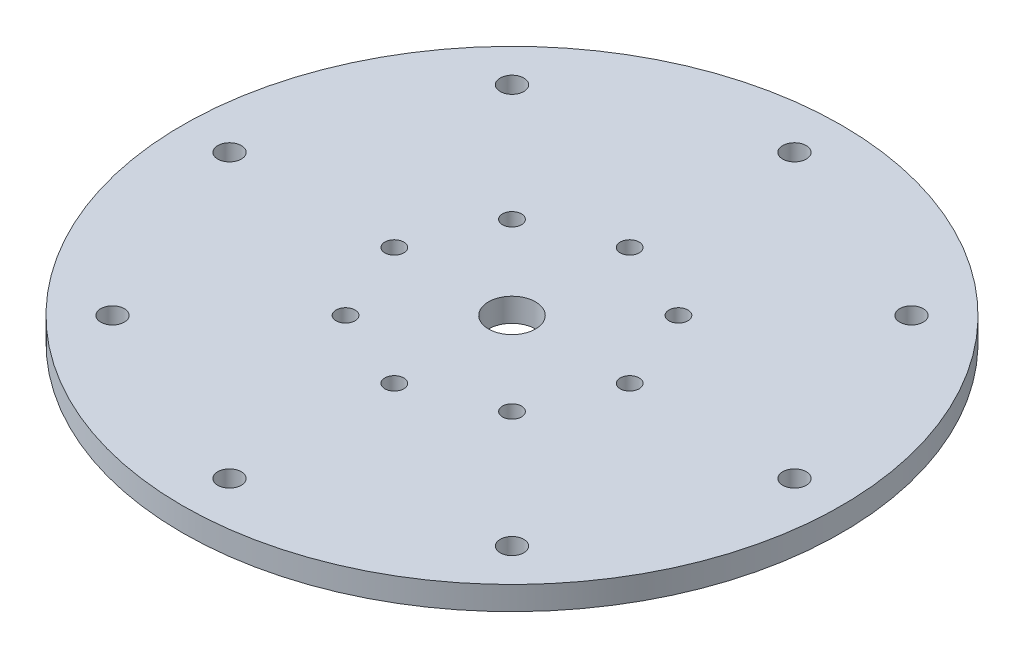
ISO-10303-21;
HEADER;
FILE_DESCRIPTION(('STEP AP214'),'2;1');
FILE_NAME('part.step','',(''),(''),'','','');
FILE_SCHEMA(('AUTOMOTIVE_DESIGN { 1 0 10303 214 1 1 1 1 }'));
ENDSEC;
DATA;
#1=APPLICATION_CONTEXT('core data for automotive mechanical design processes');
#2=APPLICATION_PROTOCOL_DEFINITION('international standard','automotive_design',2000,#1);
#3=PRODUCT_CONTEXT('',#1,'mechanical');
#4=PRODUCT('Part','Part','',(#3));
#5=PRODUCT_RELATED_PRODUCT_CATEGORY('part','',(#4));
#6=PRODUCT_DEFINITION_FORMATION('','',#4);
#7=PRODUCT_DEFINITION_CONTEXT('part definition',#1,'design');
#8=PRODUCT_DEFINITION('design','',#6,#7);
#9=PRODUCT_DEFINITION_SHAPE('','',#8);
#10=(LENGTH_UNIT() NAMED_UNIT(*) SI_UNIT(.MILLI.,.METRE.));
#11=(NAMED_UNIT(*) PLANE_ANGLE_UNIT() SI_UNIT($,.RADIAN.));
#12=(NAMED_UNIT(*) SI_UNIT($,.STERADIAN.) SOLID_ANGLE_UNIT());
#13=UNCERTAINTY_MEASURE_WITH_UNIT(LENGTH_MEASURE(1.E-05),#10,'distance_accuracy_value','');
#14=(GEOMETRIC_REPRESENTATION_CONTEXT(3) GLOBAL_UNCERTAINTY_ASSIGNED_CONTEXT((#13)) GLOBAL_UNIT_ASSIGNED_CONTEXT((#10,
#11,#12)) REPRESENTATION_CONTEXT('',''));
#15=CARTESIAN_POINT('',(0.,0.,0.));
#16=DIRECTION('',(0.,0.,1.));
#17=DIRECTION('',(1.,0.,0.));
#18=AXIS2_PLACEMENT_3D('',#15,#16,#17);
#19=CARTESIAN_POINT('',(0.,6.35,0.));
#20=DIRECTION('',(0.,1.,0.));
#21=DIRECTION('',(0.,0.,1.));
#22=AXIS2_PLACEMENT_3D('',#19,#20,#21);
#23=PLANE('',#22);
#24=CARTESIAN_POINT('',(53.8815367264156,6.35,53.8815367264143));
#25=DIRECTION('',(0.,1.,0.));
#26=DIRECTION('',(0.,0.,1.));
#27=AXIS2_PLACEMENT_3D('',#24,#25,#26);
#28=CIRCLE('',#27,3.17499999999999);
#29=CARTESIAN_POINT('',(53.8815367264156,6.35,57.0565367264142));
#30=VERTEX_POINT('',#29);
#31=EDGE_CURVE('E166',#30,#30,#28,.T.);
#32=ORIENTED_EDGE('',*,*,#31,.F.);
#33=EDGE_LOOP('',(#32));
#34=FACE_BOUND('',#33,.T.);
#35=CARTESIAN_POINT('',(7.96417910583563E-13,6.35,76.2));
#36=DIRECTION('',(0.,1.,0.));
#37=DIRECTION('',(0.,0.,1.));
#38=AXIS2_PLACEMENT_3D('',#35,#36,#37);
#39=CIRCLE('',#38,3.17499999999999);
#40=CARTESIAN_POINT('',(7.96417910583563E-13,6.35,79.375));
#41=VERTEX_POINT('',#40);
#42=EDGE_CURVE('E160',#41,#41,#39,.T.);
#43=ORIENTED_EDGE('',*,*,#42,.F.);
#44=EDGE_LOOP('',(#43));
#45=FACE_BOUND('',#44,.T.);
#46=CARTESIAN_POINT('',(-53.8815367264144,6.35,53.8815367264154));
#47=DIRECTION('',(0.,1.,0.));
#48=DIRECTION('',(0.,0.,1.));
#49=AXIS2_PLACEMENT_3D('',#46,#47,#48);
#50=CIRCLE('',#49,3.17499999999999);
#51=CARTESIAN_POINT('',(-53.8815367264144,6.35,57.0565367264154));
#52=VERTEX_POINT('',#51);
#53=EDGE_CURVE('E154',#52,#52,#50,.T.);
#54=ORIENTED_EDGE('',*,*,#53,.F.);
#55=EDGE_LOOP('',(#54));
#56=FACE_BOUND('',#55,.T.);
#57=CARTESIAN_POINT('',(-76.2,6.35,0.));
#58=DIRECTION('',(0.,1.,0.));
#59=DIRECTION('',(0.,0.,1.));
#60=AXIS2_PLACEMENT_3D('',#57,#58,#59);
#61=CIRCLE('',#60,3.17499999999998);
#62=CARTESIAN_POINT('',(-76.2,6.35,3.17499999999998));
#63=VERTEX_POINT('',#62);
#64=EDGE_CURVE('E148',#63,#63,#61,.T.);
#65=ORIENTED_EDGE('',*,*,#64,.F.);
#66=EDGE_LOOP('',(#65));
#67=FACE_BOUND('',#66,.T.);
#68=CARTESIAN_POINT('',(-53.8815367264152,6.35,-53.8815367264146));
#69=DIRECTION('',(0.,1.,0.));
#70=DIRECTION('',(0.,0.,1.));
#71=AXIS2_PLACEMENT_3D('',#68,#69,#70);
#72=CIRCLE('',#71,3.17499999999998);
#73=CARTESIAN_POINT('',(-53.8815367264152,6.35,-50.7065367264146));
#74=VERTEX_POINT('',#73);
#75=EDGE_CURVE('E142',#74,#74,#72,.T.);
#76=ORIENTED_EDGE('',*,*,#75,.F.);
#77=EDGE_LOOP('',(#76));
#78=FACE_BOUND('',#77,.T.);
#79=CARTESIAN_POINT('',(-2.6431615454387E-13,6.35,-76.2));
#80=DIRECTION('',(0.,1.,0.));
#81=DIRECTION('',(0.,0.,1.));
#82=AXIS2_PLACEMENT_3D('',#79,#80,#81);
#83=CIRCLE('',#82,3.17499999999999);
#84=CARTESIAN_POINT('',(-2.6431615454387E-13,6.35,-73.025));
#85=VERTEX_POINT('',#84);
#86=EDGE_CURVE('E136',#85,#85,#83,.T.);
#87=ORIENTED_EDGE('',*,*,#86,.F.);
#88=EDGE_LOOP('',(#87));
#89=FACE_BOUND('',#88,.T.);
#90=CARTESIAN_POINT('',(53.8815367264148,6.35,-53.881536726415));
#91=DIRECTION('',(0.,1.,0.));
#92=DIRECTION('',(0.,0.,1.));
#93=AXIS2_PLACEMENT_3D('',#90,#91,#92);
#94=CIRCLE('',#93,3.17499999999998);
#95=CARTESIAN_POINT('',(53.8815367264148,6.35,-50.706536726415));
#96=VERTEX_POINT('',#95);
#97=EDGE_CURVE('E130',#96,#96,#94,.T.);
#98=ORIENTED_EDGE('',*,*,#97,.F.);
#99=EDGE_LOOP('',(#98));
#100=FACE_BOUND('',#99,.T.);
#101=CARTESIAN_POINT('',(22.4506403026732,6.35,22.4506403026726));
#102=DIRECTION('',(0.,-1.,0.));
#103=DIRECTION('',(0.,0.,-1.));
#104=AXIS2_PLACEMENT_3D('',#101,#102,#103);
#105=CIRCLE('',#104,2.5527);
#106=CARTESIAN_POINT('',(22.4506403026732,6.35,19.8979403026726));
#107=VERTEX_POINT('',#106);
#108=EDGE_CURVE('E118',#107,#107,#105,.T.);
#109=ORIENTED_EDGE('',*,*,#108,.T.);
#110=EDGE_LOOP('',(#109));
#111=FACE_BOUND('',#110,.T.);
#112=CARTESIAN_POINT('',(3.32563597524808E-13,6.35,31.75));
#113=DIRECTION('',(0.,-1.,0.));
#114=DIRECTION('',(0.,0.,-1.));
#115=AXIS2_PLACEMENT_3D('',#112,#113,#114);
#116=CIRCLE('',#115,2.5527);
#117=CARTESIAN_POINT('',(3.32563597524808E-13,6.35,29.1973));
#118=VERTEX_POINT('',#117);
#119=EDGE_CURVE('E109',#118,#118,#116,.T.);
#120=ORIENTED_EDGE('',*,*,#119,.T.);
#121=EDGE_LOOP('',(#120));
#122=FACE_BOUND('',#121,.T.);
#123=CARTESIAN_POINT('',(-22.4506403026727,6.35,22.4506403026731));
#124=DIRECTION('',(0.,-1.,0.));
#125=DIRECTION('',(0.,0.,-1.));
#126=AXIS2_PLACEMENT_3D('',#123,#124,#125);
#127=CIRCLE('',#126,2.5527);
#128=CARTESIAN_POINT('',(-22.4506403026727,6.35,19.8979403026731));
#129=VERTEX_POINT('',#128);
#130=EDGE_CURVE('E100',#129,#129,#127,.T.);
#131=ORIENTED_EDGE('',*,*,#130,.T.);
#132=EDGE_LOOP('',(#131));
#133=FACE_BOUND('',#132,.T.);
#134=CARTESIAN_POINT('',(-31.75,6.35,0.));
#135=DIRECTION('',(0.,-1.,0.));
#136=DIRECTION('',(0.,0.,-1.));
#137=AXIS2_PLACEMENT_3D('',#134,#135,#136);
#138=CIRCLE('',#137,2.5527);
#139=CARTESIAN_POINT('',(-31.75,6.35,-2.5527));
#140=VERTEX_POINT('',#139);
#141=EDGE_CURVE('E91',#140,#140,#138,.T.);
#142=ORIENTED_EDGE('',*,*,#141,.T.);
#143=EDGE_LOOP('',(#142));
#144=FACE_BOUND('',#143,.T.);
#145=CARTESIAN_POINT('',(-22.450640302673,6.35,-22.4506403026728));
#146=DIRECTION('',(0.,-1.,0.));
#147=DIRECTION('',(0.,0.,-1.));
#148=AXIS2_PLACEMENT_3D('',#145,#146,#147);
#149=CIRCLE('',#148,2.5527);
#150=CARTESIAN_POINT('',(-22.450640302673,6.35,-25.0033403026728));
#151=VERTEX_POINT('',#150);
#152=EDGE_CURVE('E82',#151,#151,#149,.T.);
#153=ORIENTED_EDGE('',*,*,#152,.T.);
#154=EDGE_LOOP('',(#153));
#155=FACE_BOUND('',#154,.T.);
#156=CARTESIAN_POINT('',(-1.10854532508269E-13,6.35,-31.75));
#157=DIRECTION('',(0.,-1.,0.));
#158=DIRECTION('',(0.,0.,-1.));
#159=AXIS2_PLACEMENT_3D('',#156,#157,#158);
#160=CIRCLE('',#159,2.5527);
#161=CARTESIAN_POINT('',(-1.10854532508269E-13,6.35,-34.3027));
#162=VERTEX_POINT('',#161);
#163=EDGE_CURVE('E73',#162,#162,#160,.T.);
#164=ORIENTED_EDGE('',*,*,#163,.T.);
#165=EDGE_LOOP('',(#164));
#166=FACE_BOUND('',#165,.T.);
#167=CARTESIAN_POINT('',(22.4506403026728,6.35,-22.4506403026729));
#168=DIRECTION('',(0.,-1.,0.));
#169=DIRECTION('',(0.,0.,-1.));
#170=AXIS2_PLACEMENT_3D('',#167,#168,#169);
#171=CIRCLE('',#170,2.5527);
#172=CARTESIAN_POINT('',(22.4506403026728,6.35,-25.0033403026729));
#173=VERTEX_POINT('',#172);
#174=EDGE_CURVE('E64',#173,#173,#171,.T.);
#175=ORIENTED_EDGE('',*,*,#174,.T.);
#176=EDGE_LOOP('',(#175));
#177=FACE_BOUND('',#176,.T.);
#178=CARTESIAN_POINT('',(76.2,6.35,0.));
#179=DIRECTION('',(0.,1.,0.));
#180=DIRECTION('',(0.,0.,1.));
#181=AXIS2_PLACEMENT_3D('',#178,#179,#180);
#182=CIRCLE('',#181,3.17499999999998);
#183=CARTESIAN_POINT('',(76.2,6.35,3.17499999999999));
#184=VERTEX_POINT('',#183);
#185=EDGE_CURVE('E61',#184,#184,#182,.T.);
#186=ORIENTED_EDGE('',*,*,#185,.F.);
#187=EDGE_LOOP('',(#186));
#188=FACE_BOUND('',#187,.T.);
#189=CARTESIAN_POINT('',(31.75,6.35,0.));
#190=DIRECTION('',(0.,-1.,0.));
#191=DIRECTION('',(0.,0.,-1.));
#192=AXIS2_PLACEMENT_3D('',#189,#190,#191);
#193=CIRCLE('',#192,2.5527);
#194=CARTESIAN_POINT('',(31.75,6.35,-2.5527));
#195=VERTEX_POINT('',#194);
#196=EDGE_CURVE('E47',#195,#195,#193,.T.);
#197=ORIENTED_EDGE('',*,*,#196,.T.);
#198=EDGE_LOOP('',(#197));
#199=FACE_BOUND('',#198,.T.);
#200=CARTESIAN_POINT('',(0.,6.35,0.));
#201=DIRECTION('',(0.,1.,0.));
#202=DIRECTION('',(0.,0.,1.));
#203=AXIS2_PLACEMENT_3D('',#200,#201,#202);
#204=CIRCLE('',#203,88.9);
#205=CARTESIAN_POINT('',(0.,6.35,88.9));
#206=VERTEX_POINT('',#205);
#207=EDGE_CURVE('E10',#206,#206,#204,.T.);
#208=ORIENTED_EDGE('',*,*,#207,.T.);
#209=EDGE_LOOP('',(#208));
#210=FACE_BOUND('',#209,.T.);
#211=CARTESIAN_POINT('',(0.,6.35,0.));
#212=DIRECTION('',(0.,1.,0.));
#213=DIRECTION('',(0.,0.,1.));
#214=AXIS2_PLACEMENT_3D('',#211,#212,#213);
#215=CIRCLE('',#214,6.35);
#216=CARTESIAN_POINT('',(0.,6.35,6.35));
#217=VERTEX_POINT('',#216);
#218=EDGE_CURVE('E42',#217,#217,#215,.T.);
#219=ORIENTED_EDGE('',*,*,#218,.F.);
#220=EDGE_LOOP('',(#219));
#221=FACE_BOUND('',#220,.T.);
#222=ADVANCED_FACE('F31',(#34,#45,#56,#67,#78,#89,#100,#111,#122,#133,#144,#155,#166,#177,#188,
#199,#210,#221),#23,.T.);
#223=CARTESIAN_POINT('',(0.,0.,0.));
#224=DIRECTION('',(0.,1.,0.));
#225=DIRECTION('',(0.,0.,1.));
#226=AXIS2_PLACEMENT_3D('',#223,#224,#225);
#227=PLANE('',#226);
#228=CARTESIAN_POINT('',(53.8815367264156,0.,53.8815367264143));
#229=DIRECTION('',(0.,1.,0.));
#230=DIRECTION('',(0.,0.,1.));
#231=AXIS2_PLACEMENT_3D('',#228,#229,#230);
#232=CIRCLE('',#231,3.17499999999999);
#233=CARTESIAN_POINT('',(53.8815367264156,0.,57.0565367264142));
#234=VERTEX_POINT('',#233);
#235=EDGE_CURVE('E163',#234,#234,#232,.T.);
#236=ORIENTED_EDGE('',*,*,#235,.T.);
#237=EDGE_LOOP('',(#236));
#238=FACE_BOUND('',#237,.T.);
#239=CARTESIAN_POINT('',(7.96417910583563E-13,0.,76.2));
#240=DIRECTION('',(0.,1.,0.));
#241=DIRECTION('',(0.,0.,1.));
#242=AXIS2_PLACEMENT_3D('',#239,#240,#241);
#243=CIRCLE('',#242,3.17499999999999);
#244=CARTESIAN_POINT('',(7.96417910583563E-13,0.,79.375));
#245=VERTEX_POINT('',#244);
#246=EDGE_CURVE('E157',#245,#245,#243,.T.);
#247=ORIENTED_EDGE('',*,*,#246,.T.);
#248=EDGE_LOOP('',(#247));
#249=FACE_BOUND('',#248,.T.);
#250=CARTESIAN_POINT('',(-53.8815367264144,0.,53.8815367264154));
#251=DIRECTION('',(0.,1.,0.));
#252=DIRECTION('',(0.,0.,1.));
#253=AXIS2_PLACEMENT_3D('',#250,#251,#252);
#254=CIRCLE('',#253,3.17499999999999);
#255=CARTESIAN_POINT('',(-53.8815367264144,0.,57.0565367264154));
#256=VERTEX_POINT('',#255);
#257=EDGE_CURVE('E151',#256,#256,#254,.T.);
#258=ORIENTED_EDGE('',*,*,#257,.T.);
#259=EDGE_LOOP('',(#258));
#260=FACE_BOUND('',#259,.T.);
#261=CARTESIAN_POINT('',(-76.2,0.,0.));
#262=DIRECTION('',(0.,1.,0.));
#263=DIRECTION('',(0.,0.,1.));
#264=AXIS2_PLACEMENT_3D('',#261,#262,#263);
#265=CIRCLE('',#264,3.17499999999998);
#266=CARTESIAN_POINT('',(-76.2,0.,3.17499999999998));
#267=VERTEX_POINT('',#266);
#268=EDGE_CURVE('E145',#267,#267,#265,.T.);
#269=ORIENTED_EDGE('',*,*,#268,.T.);
#270=EDGE_LOOP('',(#269));
#271=FACE_BOUND('',#270,.T.);
#272=CARTESIAN_POINT('',(-53.8815367264152,0.,-53.8815367264146));
#273=DIRECTION('',(0.,1.,0.));
#274=DIRECTION('',(0.,0.,1.));
#275=AXIS2_PLACEMENT_3D('',#272,#273,#274);
#276=CIRCLE('',#275,3.17499999999998);
#277=CARTESIAN_POINT('',(-53.8815367264152,0.,-50.7065367264146));
#278=VERTEX_POINT('',#277);
#279=EDGE_CURVE('E139',#278,#278,#276,.T.);
#280=ORIENTED_EDGE('',*,*,#279,.T.);
#281=EDGE_LOOP('',(#280));
#282=FACE_BOUND('',#281,.T.);
#283=CARTESIAN_POINT('',(-2.6431615454387E-13,0.,-76.2));
#284=DIRECTION('',(0.,1.,0.));
#285=DIRECTION('',(0.,0.,1.));
#286=AXIS2_PLACEMENT_3D('',#283,#284,#285);
#287=CIRCLE('',#286,3.17499999999999);
#288=CARTESIAN_POINT('',(-2.6431615454387E-13,0.,-73.025));
#289=VERTEX_POINT('',#288);
#290=EDGE_CURVE('E133',#289,#289,#287,.T.);
#291=ORIENTED_EDGE('',*,*,#290,.T.);
#292=EDGE_LOOP('',(#291));
#293=FACE_BOUND('',#292,.T.);
#294=CARTESIAN_POINT('',(53.8815367264148,0.,-53.881536726415));
#295=DIRECTION('',(0.,1.,0.));
#296=DIRECTION('',(0.,0.,1.));
#297=AXIS2_PLACEMENT_3D('',#294,#295,#296);
#298=CIRCLE('',#297,3.17499999999998);
#299=CARTESIAN_POINT('',(53.8815367264148,0.,-50.706536726415));
#300=VERTEX_POINT('',#299);
#301=EDGE_CURVE('E127',#300,#300,#298,.T.);
#302=ORIENTED_EDGE('',*,*,#301,.T.);
#303=EDGE_LOOP('',(#302));
#304=FACE_BOUND('',#303,.T.);
#305=CARTESIAN_POINT('',(22.4506403026732,0.,22.4506403026726));
#306=DIRECTION('',(0.,-1.,0.));
#307=DIRECTION('',(0.,0.,-1.));
#308=AXIS2_PLACEMENT_3D('',#305,#306,#307);
#309=CIRCLE('',#308,4.8895);
#310=CARTESIAN_POINT('',(22.4506403026732,0.,17.5611403026726));
#311=VERTEX_POINT('',#310);
#312=EDGE_CURVE('E124',#311,#311,#309,.T.);
#313=ORIENTED_EDGE('',*,*,#312,.F.);
#314=EDGE_LOOP('',(#313));
#315=FACE_BOUND('',#314,.T.);
#316=CARTESIAN_POINT('',(3.32563597524808E-13,0.,31.75));
#317=DIRECTION('',(0.,-1.,0.));
#318=DIRECTION('',(0.,0.,-1.));
#319=AXIS2_PLACEMENT_3D('',#316,#317,#318);
#320=CIRCLE('',#319,4.8895);
#321=CARTESIAN_POINT('',(3.32563597524808E-13,0.,26.8605));
#322=VERTEX_POINT('',#321);
#323=EDGE_CURVE('E115',#322,#322,#320,.T.);
#324=ORIENTED_EDGE('',*,*,#323,.F.);
#325=EDGE_LOOP('',(#324));
#326=FACE_BOUND('',#325,.T.);
#327=CARTESIAN_POINT('',(-22.4506403026727,0.,22.4506403026731));
#328=DIRECTION('',(0.,-1.,0.));
#329=DIRECTION('',(0.,0.,-1.));
#330=AXIS2_PLACEMENT_3D('',#327,#328,#329);
#331=CIRCLE('',#330,4.8895);
#332=CARTESIAN_POINT('',(-22.4506403026727,0.,17.5611403026731));
#333=VERTEX_POINT('',#332);
#334=EDGE_CURVE('E106',#333,#333,#331,.T.);
#335=ORIENTED_EDGE('',*,*,#334,.F.);
#336=EDGE_LOOP('',(#335));
#337=FACE_BOUND('',#336,.T.);
#338=CARTESIAN_POINT('',(-31.75,0.,0.));
#339=DIRECTION('',(0.,-1.,0.));
#340=DIRECTION('',(0.,0.,-1.));
#341=AXIS2_PLACEMENT_3D('',#338,#339,#340);
#342=CIRCLE('',#341,4.8895);
#343=CARTESIAN_POINT('',(-31.75,0.,-4.8895));
#344=VERTEX_POINT('',#343);
#345=EDGE_CURVE('E97',#344,#344,#342,.T.);
#346=ORIENTED_EDGE('',*,*,#345,.F.);
#347=EDGE_LOOP('',(#346));
#348=FACE_BOUND('',#347,.T.);
#349=CARTESIAN_POINT('',(-22.450640302673,0.,-22.4506403026728));
#350=DIRECTION('',(0.,-1.,0.));
#351=DIRECTION('',(0.,0.,-1.));
#352=AXIS2_PLACEMENT_3D('',#349,#350,#351);
#353=CIRCLE('',#352,4.8895);
#354=CARTESIAN_POINT('',(-22.450640302673,0.,-27.3401403026728));
#355=VERTEX_POINT('',#354);
#356=EDGE_CURVE('E88',#355,#355,#353,.T.);
#357=ORIENTED_EDGE('',*,*,#356,.F.);
#358=EDGE_LOOP('',(#357));
#359=FACE_BOUND('',#358,.T.);
#360=CARTESIAN_POINT('',(-1.10854532508269E-13,0.,-31.75));
#361=DIRECTION('',(0.,-1.,0.));
#362=DIRECTION('',(0.,0.,-1.));
#363=AXIS2_PLACEMENT_3D('',#360,#361,#362);
#364=CIRCLE('',#363,4.8895);
#365=CARTESIAN_POINT('',(-1.10854532508269E-13,0.,-36.6395));
#366=VERTEX_POINT('',#365);
#367=EDGE_CURVE('E79',#366,#366,#364,.T.);
#368=ORIENTED_EDGE('',*,*,#367,.F.);
#369=EDGE_LOOP('',(#368));
#370=FACE_BOUND('',#369,.T.);
#371=CARTESIAN_POINT('',(22.4506403026728,0.,-22.4506403026729));
#372=DIRECTION('',(0.,-1.,0.));
#373=DIRECTION('',(0.,0.,-1.));
#374=AXIS2_PLACEMENT_3D('',#371,#372,#373);
#375=CIRCLE('',#374,4.8895);
#376=CARTESIAN_POINT('',(22.4506403026728,0.,-27.3401403026729));
#377=VERTEX_POINT('',#376);
#378=EDGE_CURVE('E70',#377,#377,#375,.T.);
#379=ORIENTED_EDGE('',*,*,#378,.F.);
#380=EDGE_LOOP('',(#379));
#381=FACE_BOUND('',#380,.T.);
#382=CARTESIAN_POINT('',(76.2,0.,0.));
#383=DIRECTION('',(0.,1.,0.));
#384=DIRECTION('',(0.,0.,1.));
#385=AXIS2_PLACEMENT_3D('',#382,#383,#384);
#386=CIRCLE('',#385,3.17499999999998);
#387=CARTESIAN_POINT('',(76.2,0.,3.17499999999999));
#388=VERTEX_POINT('',#387);
#389=EDGE_CURVE('E58',#388,#388,#386,.T.);
#390=ORIENTED_EDGE('',*,*,#389,.T.);
#391=EDGE_LOOP('',(#390));
#392=FACE_BOUND('',#391,.T.);
#393=CARTESIAN_POINT('',(31.75,0.,0.));
#394=DIRECTION('',(0.,-1.,0.));
#395=DIRECTION('',(0.,0.,-1.));
#396=AXIS2_PLACEMENT_3D('',#393,#394,#395);
#397=CIRCLE('',#396,4.8895);
#398=CARTESIAN_POINT('',(31.75,0.,-4.8895));
#399=VERTEX_POINT('',#398);
#400=EDGE_CURVE('E55',#399,#399,#397,.T.);
#401=ORIENTED_EDGE('',*,*,#400,.F.);
#402=EDGE_LOOP('',(#401));
#403=FACE_BOUND('',#402,.T.);
#404=CARTESIAN_POINT('',(0.,0.,0.));
#405=DIRECTION('',(0.,1.,0.));
#406=DIRECTION('',(0.,0.,1.));
#407=AXIS2_PLACEMENT_3D('',#404,#405,#406);
#408=CIRCLE('',#407,88.9);
#409=CARTESIAN_POINT('',(0.,0.,88.9));
#410=VERTEX_POINT('',#409);
#411=EDGE_CURVE('E35',#410,#410,#408,.T.);
#412=ORIENTED_EDGE('',*,*,#411,.F.);
#413=EDGE_LOOP('',(#412));
#414=FACE_BOUND('',#413,.T.);
#415=CARTESIAN_POINT('',(0.,0.,0.));
#416=DIRECTION('',(0.,1.,0.));
#417=DIRECTION('',(0.,0.,1.));
#418=AXIS2_PLACEMENT_3D('',#415,#416,#417);
#419=CIRCLE('',#418,6.35);
#420=CARTESIAN_POINT('',(0.,0.,6.35));
#421=VERTEX_POINT('',#420);
#422=EDGE_CURVE('E44',#421,#421,#419,.T.);
#423=ORIENTED_EDGE('',*,*,#422,.T.);
#424=EDGE_LOOP('',(#423));
#425=FACE_BOUND('',#424,.T.);
#426=ADVANCED_FACE('F174',(#238,#249,#260,#271,#282,#293,#304,#315,#326,#337,#348,#359,#370,
#381,#392,#403,#414,#425),#227,.F.);
#427=CARTESIAN_POINT('',(0.,6.35,0.));
#428=DIRECTION('',(0.,-1.,0.));
#429=DIRECTION('',(0.,0.,-1.));
#430=AXIS2_PLACEMENT_3D('',#427,#428,#429);
#431=CYLINDRICAL_SURFACE('',#430,88.9);
#432=ORIENTED_EDGE('',*,*,#207,.F.);
#433=EDGE_LOOP('',(#432));
#434=FACE_BOUND('',#433,.T.);
#435=ORIENTED_EDGE('',*,*,#411,.T.);
#436=EDGE_LOOP('',(#435));
#437=FACE_BOUND('',#436,.T.);
#438=ADVANCED_FACE('F33',(#434,#437),#431,.T.);
#439=CARTESIAN_POINT('',(0.,6.35,0.));
#440=DIRECTION('',(0.,-1.,0.));
#441=DIRECTION('',(0.,0.,-1.));
#442=AXIS2_PLACEMENT_3D('',#439,#440,#441);
#443=CYLINDRICAL_SURFACE('',#442,6.35);
#444=ORIENTED_EDGE('',*,*,#218,.T.);
#445=EDGE_LOOP('',(#444));
#446=FACE_BOUND('',#445,.T.);
#447=ORIENTED_EDGE('',*,*,#422,.F.);
#448=EDGE_LOOP('',(#447));
#449=FACE_BOUND('',#448,.T.);
#450=ADVANCED_FACE('F208',(#446,#449),#443,.F.);
#451=CARTESIAN_POINT('',(31.75,0.,0.));
#452=DIRECTION('',(0.,-1.,0.));
#453=DIRECTION('',(0.,0.,-1.));
#454=AXIS2_PLACEMENT_3D('',#451,#452,#453);
#455=CYLINDRICAL_SURFACE('',#454,2.5527);
#456=ORIENTED_EDGE('',*,*,#196,.F.);
#457=EDGE_LOOP('',(#456));
#458=FACE_BOUND('',#457,.T.);
#459=CARTESIAN_POINT('',(31.75,1.96080801813507,0.));
#460=DIRECTION('',(0.,-1.,0.));
#461=DIRECTION('',(0.,0.,-1.));
#462=AXIS2_PLACEMENT_3D('',#459,#460,#461);
#463=CIRCLE('',#462,2.5527);
#464=CARTESIAN_POINT('',(31.75,1.96080801813507,-2.5527));
#465=VERTEX_POINT('',#464);
#466=EDGE_CURVE('E52',#465,#465,#463,.T.);
#467=ORIENTED_EDGE('',*,*,#466,.T.);
#468=EDGE_LOOP('',(#467));
#469=FACE_BOUND('',#468,.T.);
#470=ADVANCED_FACE('F211',(#458,#469),#455,.F.);
#471=CARTESIAN_POINT('',(31.75,0.,0.));
#472=DIRECTION('',(0.,-1.,0.));
#473=DIRECTION('',(0.,0.,-1.));
#474=AXIS2_PLACEMENT_3D('',#471,#472,#473);
#475=CONICAL_SURFACE('',#474,4.8895,0.872664625997164);
#476=ORIENTED_EDGE('',*,*,#466,.F.);
#477=EDGE_LOOP('',(#476));
#478=FACE_BOUND('',#477,.T.);
#479=ORIENTED_EDGE('',*,*,#400,.T.);
#480=EDGE_LOOP('',(#479));
#481=FACE_BOUND('',#480,.T.);
#482=ADVANCED_FACE('F225',(#478,#481),#475,.F.);
#483=CARTESIAN_POINT('',(76.2,6.35,0.));
#484=DIRECTION('',(0.,1.,0.));
#485=DIRECTION('',(0.,0.,1.));
#486=AXIS2_PLACEMENT_3D('',#483,#484,#485);
#487=CYLINDRICAL_SURFACE('',#486,3.17499999999998);
#488=ORIENTED_EDGE('',*,*,#389,.F.);
#489=EDGE_LOOP('',(#488));
#490=FACE_BOUND('',#489,.T.);
#491=ORIENTED_EDGE('',*,*,#185,.T.);
#492=EDGE_LOOP('',(#491));
#493=FACE_BOUND('',#492,.T.);
#494=ADVANCED_FACE('F229',(#490,#493),#487,.F.);
#495=CARTESIAN_POINT('',(22.4506403026728,0.,-22.4506403026729));
#496=DIRECTION('',(0.,-1.,0.));
#497=DIRECTION('',(0.,0.,-1.));
#498=AXIS2_PLACEMENT_3D('',#495,#496,#497);
#499=CYLINDRICAL_SURFACE('',#498,2.5527);
#500=ORIENTED_EDGE('',*,*,#174,.F.);
#501=EDGE_LOOP('',(#500));
#502=FACE_BOUND('',#501,.T.);
#503=CARTESIAN_POINT('',(22.4506403026728,1.96080801813507,-22.4506403026729));
#504=DIRECTION('',(0.,-1.,0.));
#505=DIRECTION('',(0.,0.,-1.));
#506=AXIS2_PLACEMENT_3D('',#503,#504,#505);
#507=CIRCLE('',#506,2.5527);
#508=CARTESIAN_POINT('',(22.4506403026728,1.96080801813507,-25.0033403026729));
#509=VERTEX_POINT('',#508);
#510=EDGE_CURVE('E67',#509,#509,#507,.T.);
#511=ORIENTED_EDGE('',*,*,#510,.T.);
#512=EDGE_LOOP('',(#511));
#513=FACE_BOUND('',#512,.T.);
#514=ADVANCED_FACE('F233',(#502,#513),#499,.F.);
#515=CARTESIAN_POINT('',(22.4506403026728,0.,-22.4506403026729));
#516=DIRECTION('',(0.,-1.,0.));
#517=DIRECTION('',(0.,0.,-1.));
#518=AXIS2_PLACEMENT_3D('',#515,#516,#517);
#519=CONICAL_SURFACE('',#518,4.8895,0.872664625997164);
#520=ORIENTED_EDGE('',*,*,#510,.F.);
#521=EDGE_LOOP('',(#520));
#522=FACE_BOUND('',#521,.T.);
#523=ORIENTED_EDGE('',*,*,#378,.T.);
#524=EDGE_LOOP('',(#523));
#525=FACE_BOUND('',#524,.T.);
#526=ADVANCED_FACE('F237',(#522,#525),#519,.F.);
#527=CARTESIAN_POINT('',(-1.10854532508269E-13,0.,-31.75));
#528=DIRECTION('',(0.,-1.,0.));
#529=DIRECTION('',(0.,0.,-1.));
#530=AXIS2_PLACEMENT_3D('',#527,#528,#529);
#531=CYLINDRICAL_SURFACE('',#530,2.5527);
#532=ORIENTED_EDGE('',*,*,#163,.F.);
#533=EDGE_LOOP('',(#532));
#534=FACE_BOUND('',#533,.T.);
#535=CARTESIAN_POINT('',(-1.10854532508269E-13,1.96080801813507,-31.75));
#536=DIRECTION('',(0.,-1.,0.));
#537=DIRECTION('',(0.,0.,-1.));
#538=AXIS2_PLACEMENT_3D('',#535,#536,#537);
#539=CIRCLE('',#538,2.5527);
#540=CARTESIAN_POINT('',(-1.10854532508269E-13,1.96080801813507,-34.3027));
#541=VERTEX_POINT('',#540);
#542=EDGE_CURVE('E76',#541,#541,#539,.T.);
#543=ORIENTED_EDGE('',*,*,#542,.T.);
#544=EDGE_LOOP('',(#543));
#545=FACE_BOUND('',#544,.T.);
#546=ADVANCED_FACE('F241',(#534,#545),#531,.F.);
#547=CARTESIAN_POINT('',(-1.10854532508269E-13,0.,-31.75));
#548=DIRECTION('',(0.,-1.,0.));
#549=DIRECTION('',(0.,0.,-1.));
#550=AXIS2_PLACEMENT_3D('',#547,#548,#549);
#551=CONICAL_SURFACE('',#550,4.8895,0.872664625997164);
#552=ORIENTED_EDGE('',*,*,#542,.F.);
#553=EDGE_LOOP('',(#552));
#554=FACE_BOUND('',#553,.T.);
#555=ORIENTED_EDGE('',*,*,#367,.T.);
#556=EDGE_LOOP('',(#555));
#557=FACE_BOUND('',#556,.T.);
#558=ADVANCED_FACE('F245',(#554,#557),#551,.F.);
#559=CARTESIAN_POINT('',(-22.450640302673,0.,-22.4506403026728));
#560=DIRECTION('',(0.,-1.,0.));
#561=DIRECTION('',(0.,0.,-1.));
#562=AXIS2_PLACEMENT_3D('',#559,#560,#561);
#563=CYLINDRICAL_SURFACE('',#562,2.5527);
#564=ORIENTED_EDGE('',*,*,#152,.F.);
#565=EDGE_LOOP('',(#564));
#566=FACE_BOUND('',#565,.T.);
#567=CARTESIAN_POINT('',(-22.450640302673,1.96080801813507,-22.4506403026728));
#568=DIRECTION('',(0.,-1.,0.));
#569=DIRECTION('',(0.,0.,-1.));
#570=AXIS2_PLACEMENT_3D('',#567,#568,#569);
#571=CIRCLE('',#570,2.5527);
#572=CARTESIAN_POINT('',(-22.450640302673,1.96080801813507,-25.0033403026728));
#573=VERTEX_POINT('',#572);
#574=EDGE_CURVE('E85',#573,#573,#571,.T.);
#575=ORIENTED_EDGE('',*,*,#574,.T.);
#576=EDGE_LOOP('',(#575));
#577=FACE_BOUND('',#576,.T.);
#578=ADVANCED_FACE('F249',(#566,#577),#563,.F.);
#579=CARTESIAN_POINT('',(-22.450640302673,0.,-22.4506403026728));
#580=DIRECTION('',(0.,-1.,0.));
#581=DIRECTION('',(0.,0.,-1.));
#582=AXIS2_PLACEMENT_3D('',#579,#580,#581);
#583=CONICAL_SURFACE('',#582,4.8895,0.872664625997165);
#584=ORIENTED_EDGE('',*,*,#574,.F.);
#585=EDGE_LOOP('',(#584));
#586=FACE_BOUND('',#585,.T.);
#587=ORIENTED_EDGE('',*,*,#356,.T.);
#588=EDGE_LOOP('',(#587));
#589=FACE_BOUND('',#588,.T.);
#590=ADVANCED_FACE('F253',(#586,#589),#583,.F.);
#591=CARTESIAN_POINT('',(-31.75,0.,0.));
#592=DIRECTION('',(0.,-1.,0.));
#593=DIRECTION('',(0.,0.,-1.));
#594=AXIS2_PLACEMENT_3D('',#591,#592,#593);
#595=CYLINDRICAL_SURFACE('',#594,2.5527);
#596=ORIENTED_EDGE('',*,*,#141,.F.);
#597=EDGE_LOOP('',(#596));
#598=FACE_BOUND('',#597,.T.);
#599=CARTESIAN_POINT('',(-31.75,1.96080801813507,0.));
#600=DIRECTION('',(0.,-1.,0.));
#601=DIRECTION('',(0.,0.,-1.));
#602=AXIS2_PLACEMENT_3D('',#599,#600,#601);
#603=CIRCLE('',#602,2.5527);
#604=CARTESIAN_POINT('',(-31.75,1.96080801813507,-2.5527));
#605=VERTEX_POINT('',#604);
#606=EDGE_CURVE('E94',#605,#605,#603,.T.);
#607=ORIENTED_EDGE('',*,*,#606,.T.);
#608=EDGE_LOOP('',(#607));
#609=FACE_BOUND('',#608,.T.);
#610=ADVANCED_FACE('F257',(#598,#609),#595,.F.);
#611=CARTESIAN_POINT('',(-31.75,0.,0.));
#612=DIRECTION('',(0.,-1.,0.));
#613=DIRECTION('',(0.,0.,-1.));
#614=AXIS2_PLACEMENT_3D('',#611,#612,#613);
#615=CONICAL_SURFACE('',#614,4.8895,0.872664625997164);
#616=ORIENTED_EDGE('',*,*,#606,.F.);
#617=EDGE_LOOP('',(#616));
#618=FACE_BOUND('',#617,.T.);
#619=ORIENTED_EDGE('',*,*,#345,.T.);
#620=EDGE_LOOP('',(#619));
#621=FACE_BOUND('',#620,.T.);
#622=ADVANCED_FACE('F261',(#618,#621),#615,.F.);
#623=CARTESIAN_POINT('',(-22.4506403026727,0.,22.4506403026731));
#624=DIRECTION('',(0.,-1.,0.));
#625=DIRECTION('',(0.,0.,-1.));
#626=AXIS2_PLACEMENT_3D('',#623,#624,#625);
#627=CYLINDRICAL_SURFACE('',#626,2.5527);
#628=ORIENTED_EDGE('',*,*,#130,.F.);
#629=EDGE_LOOP('',(#628));
#630=FACE_BOUND('',#629,.T.);
#631=CARTESIAN_POINT('',(-22.4506403026727,1.96080801813507,22.4506403026731));
#632=DIRECTION('',(0.,-1.,0.));
#633=DIRECTION('',(0.,0.,-1.));
#634=AXIS2_PLACEMENT_3D('',#631,#632,#633);
#635=CIRCLE('',#634,2.5527);
#636=CARTESIAN_POINT('',(-22.4506403026727,1.96080801813507,19.8979403026731));
#637=VERTEX_POINT('',#636);
#638=EDGE_CURVE('E103',#637,#637,#635,.T.);
#639=ORIENTED_EDGE('',*,*,#638,.T.);
#640=EDGE_LOOP('',(#639));
#641=FACE_BOUND('',#640,.T.);
#642=ADVANCED_FACE('F265',(#630,#641),#627,.F.);
#643=CARTESIAN_POINT('',(-22.4506403026727,0.,22.4506403026731));
#644=DIRECTION('',(0.,-1.,0.));
#645=DIRECTION('',(0.,0.,-1.));
#646=AXIS2_PLACEMENT_3D('',#643,#644,#645);
#647=CONICAL_SURFACE('',#646,4.8895,0.872664625997165);
#648=ORIENTED_EDGE('',*,*,#638,.F.);
#649=EDGE_LOOP('',(#648));
#650=FACE_BOUND('',#649,.T.);
#651=ORIENTED_EDGE('',*,*,#334,.T.);
#652=EDGE_LOOP('',(#651));
#653=FACE_BOUND('',#652,.T.);
#654=ADVANCED_FACE('F269',(#650,#653),#647,.F.);
#655=CARTESIAN_POINT('',(3.32563597524808E-13,0.,31.75));
#656=DIRECTION('',(0.,-1.,0.));
#657=DIRECTION('',(0.,0.,-1.));
#658=AXIS2_PLACEMENT_3D('',#655,#656,#657);
#659=CYLINDRICAL_SURFACE('',#658,2.5527);
#660=ORIENTED_EDGE('',*,*,#119,.F.);
#661=EDGE_LOOP('',(#660));
#662=FACE_BOUND('',#661,.T.);
#663=CARTESIAN_POINT('',(3.32563597524808E-13,1.96080801813507,31.75));
#664=DIRECTION('',(0.,-1.,0.));
#665=DIRECTION('',(0.,0.,-1.));
#666=AXIS2_PLACEMENT_3D('',#663,#664,#665);
#667=CIRCLE('',#666,2.5527);
#668=CARTESIAN_POINT('',(3.32563597524808E-13,1.96080801813507,29.1973));
#669=VERTEX_POINT('',#668);
#670=EDGE_CURVE('E112',#669,#669,#667,.T.);
#671=ORIENTED_EDGE('',*,*,#670,.T.);
#672=EDGE_LOOP('',(#671));
#673=FACE_BOUND('',#672,.T.);
#674=ADVANCED_FACE('F273',(#662,#673),#659,.F.);
#675=CARTESIAN_POINT('',(3.32563597524808E-13,0.,31.75));
#676=DIRECTION('',(0.,-1.,0.));
#677=DIRECTION('',(0.,0.,-1.));
#678=AXIS2_PLACEMENT_3D('',#675,#676,#677);
#679=CONICAL_SURFACE('',#678,4.8895,0.872664625997164);
#680=ORIENTED_EDGE('',*,*,#670,.F.);
#681=EDGE_LOOP('',(#680));
#682=FACE_BOUND('',#681,.T.);
#683=ORIENTED_EDGE('',*,*,#323,.T.);
#684=EDGE_LOOP('',(#683));
#685=FACE_BOUND('',#684,.T.);
#686=ADVANCED_FACE('F277',(#682,#685),#679,.F.);
#687=CARTESIAN_POINT('',(22.4506403026732,0.,22.4506403026726));
#688=DIRECTION('',(0.,-1.,0.));
#689=DIRECTION('',(0.,0.,-1.));
#690=AXIS2_PLACEMENT_3D('',#687,#688,#689);
#691=CYLINDRICAL_SURFACE('',#690,2.5527);
#692=ORIENTED_EDGE('',*,*,#108,.F.);
#693=EDGE_LOOP('',(#692));
#694=FACE_BOUND('',#693,.T.);
#695=CARTESIAN_POINT('',(22.4506403026732,1.96080801813507,22.4506403026726));
#696=DIRECTION('',(0.,-1.,0.));
#697=DIRECTION('',(0.,0.,-1.));
#698=AXIS2_PLACEMENT_3D('',#695,#696,#697);
#699=CIRCLE('',#698,2.5527);
#700=CARTESIAN_POINT('',(22.4506403026732,1.96080801813507,19.8979403026726));
#701=VERTEX_POINT('',#700);
#702=EDGE_CURVE('E121',#701,#701,#699,.T.);
#703=ORIENTED_EDGE('',*,*,#702,.T.);
#704=EDGE_LOOP('',(#703));
#705=FACE_BOUND('',#704,.T.);
#706=ADVANCED_FACE('F281',(#694,#705),#691,.F.);
#707=CARTESIAN_POINT('',(22.4506403026732,0.,22.4506403026726));
#708=DIRECTION('',(0.,-1.,0.));
#709=DIRECTION('',(0.,0.,-1.));
#710=AXIS2_PLACEMENT_3D('',#707,#708,#709);
#711=CONICAL_SURFACE('',#710,4.8895,0.872664625997164);
#712=ORIENTED_EDGE('',*,*,#702,.F.);
#713=EDGE_LOOP('',(#712));
#714=FACE_BOUND('',#713,.T.);
#715=ORIENTED_EDGE('',*,*,#312,.T.);
#716=EDGE_LOOP('',(#715));
#717=FACE_BOUND('',#716,.T.);
#718=ADVANCED_FACE('F285',(#714,#717),#711,.F.);
#719=CARTESIAN_POINT('',(53.8815367264148,6.35,-53.881536726415));
#720=DIRECTION('',(0.,1.,0.));
#721=DIRECTION('',(0.,0.,1.));
#722=AXIS2_PLACEMENT_3D('',#719,#720,#721);
#723=CYLINDRICAL_SURFACE('',#722,3.17499999999998);
#724=ORIENTED_EDGE('',*,*,#301,.F.);
#725=EDGE_LOOP('',(#724));
#726=FACE_BOUND('',#725,.T.);
#727=ORIENTED_EDGE('',*,*,#97,.T.);
#728=EDGE_LOOP('',(#727));
#729=FACE_BOUND('',#728,.T.);
#730=ADVANCED_FACE('F289',(#726,#729),#723,.F.);
#731=CARTESIAN_POINT('',(-2.6431615454387E-13,6.35,-76.2));
#732=DIRECTION('',(0.,1.,0.));
#733=DIRECTION('',(0.,0.,1.));
#734=AXIS2_PLACEMENT_3D('',#731,#732,#733);
#735=CYLINDRICAL_SURFACE('',#734,3.17499999999999);
#736=ORIENTED_EDGE('',*,*,#290,.F.);
#737=EDGE_LOOP('',(#736));
#738=FACE_BOUND('',#737,.T.);
#739=ORIENTED_EDGE('',*,*,#86,.T.);
#740=EDGE_LOOP('',(#739));
#741=FACE_BOUND('',#740,.T.);
#742=ADVANCED_FACE('F293',(#738,#741),#735,.F.);
#743=CARTESIAN_POINT('',(-53.8815367264152,6.35,-53.8815367264146));
#744=DIRECTION('',(0.,1.,0.));
#745=DIRECTION('',(0.,0.,1.));
#746=AXIS2_PLACEMENT_3D('',#743,#744,#745);
#747=CYLINDRICAL_SURFACE('',#746,3.17499999999998);
#748=ORIENTED_EDGE('',*,*,#279,.F.);
#749=EDGE_LOOP('',(#748));
#750=FACE_BOUND('',#749,.T.);
#751=ORIENTED_EDGE('',*,*,#75,.T.);
#752=EDGE_LOOP('',(#751));
#753=FACE_BOUND('',#752,.T.);
#754=ADVANCED_FACE('F297',(#750,#753),#747,.F.);
#755=CARTESIAN_POINT('',(-76.2,6.35,0.));
#756=DIRECTION('',(0.,1.,0.));
#757=DIRECTION('',(0.,0.,1.));
#758=AXIS2_PLACEMENT_3D('',#755,#756,#757);
#759=CYLINDRICAL_SURFACE('',#758,3.17499999999998);
#760=ORIENTED_EDGE('',*,*,#268,.F.);
#761=EDGE_LOOP('',(#760));
#762=FACE_BOUND('',#761,.T.);
#763=ORIENTED_EDGE('',*,*,#64,.T.);
#764=EDGE_LOOP('',(#763));
#765=FACE_BOUND('',#764,.T.);
#766=ADVANCED_FACE('F301',(#762,#765),#759,.F.);
#767=CARTESIAN_POINT('',(-53.8815367264144,6.35,53.8815367264154));
#768=DIRECTION('',(0.,1.,0.));
#769=DIRECTION('',(0.,0.,1.));
#770=AXIS2_PLACEMENT_3D('',#767,#768,#769);
#771=CYLINDRICAL_SURFACE('',#770,3.17499999999999);
#772=ORIENTED_EDGE('',*,*,#257,.F.);
#773=EDGE_LOOP('',(#772));
#774=FACE_BOUND('',#773,.T.);
#775=ORIENTED_EDGE('',*,*,#53,.T.);
#776=EDGE_LOOP('',(#775));
#777=FACE_BOUND('',#776,.T.);
#778=ADVANCED_FACE('F305',(#774,#777),#771,.F.);
#779=CARTESIAN_POINT('',(7.96417910583563E-13,6.35,76.2));
#780=DIRECTION('',(0.,1.,0.));
#781=DIRECTION('',(0.,0.,1.));
#782=AXIS2_PLACEMENT_3D('',#779,#780,#781);
#783=CYLINDRICAL_SURFACE('',#782,3.17499999999999);
#784=ORIENTED_EDGE('',*,*,#246,.F.);
#785=EDGE_LOOP('',(#784));
#786=FACE_BOUND('',#785,.T.);
#787=ORIENTED_EDGE('',*,*,#42,.T.);
#788=EDGE_LOOP('',(#787));
#789=FACE_BOUND('',#788,.T.);
#790=ADVANCED_FACE('F309',(#786,#789),#783,.F.);
#791=CARTESIAN_POINT('',(53.8815367264156,6.35,53.8815367264143));
#792=DIRECTION('',(0.,1.,0.));
#793=DIRECTION('',(0.,0.,1.));
#794=AXIS2_PLACEMENT_3D('',#791,#792,#793);
#795=CYLINDRICAL_SURFACE('',#794,3.17499999999999);
#796=ORIENTED_EDGE('',*,*,#235,.F.);
#797=EDGE_LOOP('',(#796));
#798=FACE_BOUND('',#797,.T.);
#799=ORIENTED_EDGE('',*,*,#31,.T.);
#800=EDGE_LOOP('',(#799));
#801=FACE_BOUND('',#800,.T.);
#802=ADVANCED_FACE('F170',(#798,#801),#795,.F.);
#803=CLOSED_SHELL('',(#222,#426,#438,#450,#470,#482,#494,#514,#526,#546,#558,#578,#590,#610,
#622,#642,#654,#674,#686,#706,#718,#730,#742,#754,#766,#778,#790,#802));
#804=MANIFOLD_SOLID_BREP('B2',#803);
#805=ADVANCED_BREP_SHAPE_REPRESENTATION('',(#18,#804),#14);
#806=SHAPE_DEFINITION_REPRESENTATION(#9,#805);
ENDSEC;
END-ISO-10303-21;
